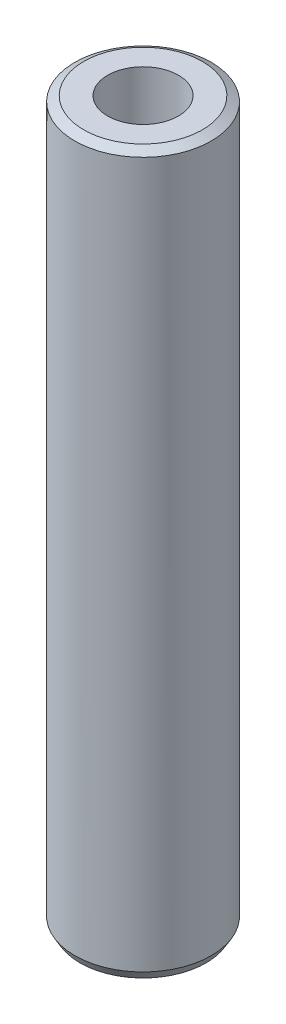
ISO-10303-21;
HEADER;
FILE_DESCRIPTION(('STEP AP214'),'2;1');
FILE_NAME('part.step','',(''),(''),'','','');
FILE_SCHEMA(('AUTOMOTIVE_DESIGN { 1 0 10303 214 1 1 1 1 }'));
ENDSEC;
DATA;
#1=APPLICATION_CONTEXT('core data for automotive mechanical design processes');
#2=APPLICATION_PROTOCOL_DEFINITION('international standard','automotive_design',2000,#1);
#3=PRODUCT_CONTEXT('',#1,'mechanical');
#4=PRODUCT('Part','Part','',(#3));
#5=PRODUCT_RELATED_PRODUCT_CATEGORY('part','',(#4));
#6=PRODUCT_DEFINITION_FORMATION('','',#4);
#7=PRODUCT_DEFINITION_CONTEXT('part definition',#1,'design');
#8=PRODUCT_DEFINITION('design','',#6,#7);
#9=PRODUCT_DEFINITION_SHAPE('','',#8);
#10=(LENGTH_UNIT() NAMED_UNIT(*) SI_UNIT(.MILLI.,.METRE.));
#11=(NAMED_UNIT(*) PLANE_ANGLE_UNIT() SI_UNIT($,.RADIAN.));
#12=(NAMED_UNIT(*) SI_UNIT($,.STERADIAN.) SOLID_ANGLE_UNIT());
#13=UNCERTAINTY_MEASURE_WITH_UNIT(LENGTH_MEASURE(1.E-05),#10,'distance_accuracy_value','');
#14=(GEOMETRIC_REPRESENTATION_CONTEXT(3) GLOBAL_UNCERTAINTY_ASSIGNED_CONTEXT((#13)) GLOBAL_UNIT_ASSIGNED_CONTEXT((#10,
#11,#12)) REPRESENTATION_CONTEXT('',''));
#15=CARTESIAN_POINT('',(0.,0.,0.));
#16=DIRECTION('',(0.,0.,1.));
#17=DIRECTION('',(1.,0.,0.));
#18=AXIS2_PLACEMENT_3D('',#15,#16,#17);
#19=CARTESIAN_POINT('',(0.,395.5855916354,0.));
#20=DIRECTION('',(0.,-1.,0.));
#21=DIRECTION('',(0.,0.,-1.));
#22=AXIS2_PLACEMENT_3D('',#19,#20,#21);
#23=CYLINDRICAL_SURFACE('',#22,37.5);
#24=CARTESIAN_POINT('',(0.,392.724823864687,0.));
#25=DIRECTION('',(0.,1.,0.));
#26=DIRECTION('',(0.,0.,1.));
#27=AXIS2_PLACEMENT_3D('',#24,#25,#26);
#28=CIRCLE('',#27,37.5);
#29=CARTESIAN_POINT('',(0.,392.724823864687,-37.5000000000001));
#30=VERTEX_POINT('',#29);
#31=EDGE_CURVE('E50',#30,#30,#28,.F.);
#32=ORIENTED_EDGE('',*,*,#31,.T.);
#33=EDGE_LOOP('',(#32));
#34=FACE_BOUND('',#33,.T.);
#35=CARTESIAN_POINT('',(0.,4.90157928391394,0.));
#36=DIRECTION('',(0.,1.,0.));
#37=DIRECTION('',(0.,0.,1.));
#38=AXIS2_PLACEMENT_3D('',#35,#36,#37);
#39=CIRCLE('',#38,37.5);
#40=CARTESIAN_POINT('',(0.,4.90157928391394,37.5));
#41=VERTEX_POINT('',#40);
#42=EDGE_CURVE('E51',#41,#41,#39,.T.);
#43=ORIENTED_EDGE('',*,*,#42,.T.);
#44=EDGE_LOOP('',(#43));
#45=FACE_BOUND('',#44,.T.);
#46=ADVANCED_FACE('F39',(#34,#45),#23,.T.);
#47=CARTESIAN_POINT('',(0.,395.5855916354,0.));
#48=DIRECTION('',(0.,1.,0.));
#49=DIRECTION('',(0.,0.,1.));
#50=AXIS2_PLACEMENT_3D('',#47,#48,#49);
#51=PLANE('',#50);
#52=CARTESIAN_POINT('',(0.,395.5855916354,0.));
#53=DIRECTION('',(0.,1.,0.));
#54=DIRECTION('',(0.,0.,1.));
#55=AXIS2_PLACEMENT_3D('',#52,#53,#54);
#56=CIRCLE('',#55,32.5984207160859);
#57=CARTESIAN_POINT('',(0.,395.5855916354,-32.5984207160859));
#58=VERTEX_POINT('',#57);
#59=EDGE_CURVE('E54',#58,#58,#56,.T.);
#60=ORIENTED_EDGE('',*,*,#59,.T.);
#61=EDGE_LOOP('',(#60));
#62=FACE_BOUND('',#61,.T.);
#63=CARTESIAN_POINT('',(0.,395.5855916354,0.));
#64=DIRECTION('',(0.,1.,0.));
#65=DIRECTION('',(0.,0.,1.));
#66=AXIS2_PLACEMENT_3D('',#63,#64,#65);
#67=CIRCLE('',#66,19.4556206193106);
#68=CARTESIAN_POINT('',(0.,395.5855916354,19.4556206193106));
#69=VERTEX_POINT('',#68);
#70=EDGE_CURVE('E58',#69,#69,#67,.T.);
#71=ORIENTED_EDGE('',*,*,#70,.F.);
#72=EDGE_LOOP('',(#71));
#73=FACE_BOUND('',#72,.T.);
#74=ADVANCED_FACE('F69',(#62,#73),#51,.T.);
#75=CARTESIAN_POINT('',(0.,0.,0.));
#76=DIRECTION('',(0.,1.,0.));
#77=DIRECTION('',(0.,0.,1.));
#78=AXIS2_PLACEMENT_3D('',#75,#76,#77);
#79=PLANE('',#78);
#80=CARTESIAN_POINT('',(0.,0.,0.));
#81=DIRECTION('',(0.,1.,0.));
#82=DIRECTION('',(0.,0.,1.));
#83=AXIS2_PLACEMENT_3D('',#80,#81,#82);
#84=CIRCLE('',#83,34.6392322292875);
#85=CARTESIAN_POINT('',(0.,0.,34.6392322292875));
#86=VERTEX_POINT('',#85);
#87=EDGE_CURVE('E10',#86,#86,#84,.F.);
#88=ORIENTED_EDGE('',*,*,#87,.T.);
#89=EDGE_LOOP('',(#88));
#90=FACE_BOUND('',#89,.T.);
#91=CARTESIAN_POINT('',(0.,0.,0.));
#92=DIRECTION('',(0.,1.,0.));
#93=DIRECTION('',(0.,0.,1.));
#94=AXIS2_PLACEMENT_3D('',#91,#92,#93);
#95=CIRCLE('',#94,19.4556206193106);
#96=CARTESIAN_POINT('',(0.,0.,19.4556206193106));
#97=VERTEX_POINT('',#96);
#98=EDGE_CURVE('E63',#97,#97,#95,.T.);
#99=ORIENTED_EDGE('',*,*,#98,.T.);
#100=EDGE_LOOP('',(#99));
#101=FACE_BOUND('',#100,.T.);
#102=ADVANCED_FACE('F75',(#90,#101),#79,.F.);
#103=CARTESIAN_POINT('',(0.,395.5855916354,0.));
#104=DIRECTION('',(0.,-1.,0.));
#105=DIRECTION('',(0.,0.,-1.));
#106=AXIS2_PLACEMENT_3D('',#103,#104,#105);
#107=CYLINDRICAL_SURFACE('',#106,19.4556206193106);
#108=ORIENTED_EDGE('',*,*,#70,.T.);
#109=EDGE_LOOP('',(#108));
#110=FACE_BOUND('',#109,.T.);
#111=ORIENTED_EDGE('',*,*,#98,.F.);
#112=EDGE_LOOP('',(#111));
#113=FACE_BOUND('',#112,.T.);
#114=ADVANCED_FACE('F70',(#110,#113),#107,.F.);
#115=CARTESIAN_POINT('',(0.,395.5855916354,0.));
#116=DIRECTION('',(0.,-1.,0.));
#117=DIRECTION('',(0.,0.,-1.));
#118=AXIS2_PLACEMENT_3D('',#115,#116,#117);
#119=CONICAL_SURFACE('',#118,32.5984207160859,1.04249157313544);
#120=CARTESIAN_POINT('',(0.,392.724823864687,-37.5000000000001));
#121=CARTESIAN_POINT('',(0.,392.754623528965,-37.4489418824593));
#122=CARTESIAN_POINT('',(0.,392.784423193244,-37.3978837649185));
#123=CARTESIAN_POINT('',(0.,392.8440225218,-37.295767529837));
#124=CARTESIAN_POINT('',(0.,392.873822186078,-37.2447094122962));
#125=CARTESIAN_POINT('',(0.,392.933421514635,-37.1425931772146));
#126=CARTESIAN_POINT('',(0.,392.963221178913,-37.0915350596739));
#127=CARTESIAN_POINT('',(0.,393.02282050747,-36.9894188245923));
#128=CARTESIAN_POINT('',(0.,393.052620171748,-36.9383607070516));
#129=CARTESIAN_POINT('',(0.,393.112219500304,-36.83624447197));
#130=CARTESIAN_POINT('',(0.,393.142019164583,-36.7851863544292));
#131=CARTESIAN_POINT('',(0.,393.201618493139,-36.6830701193477));
#132=CARTESIAN_POINT('',(0.,393.231418157417,-36.6320120018069));
#133=CARTESIAN_POINT('',(0.,393.291017485974,-36.5298957667254));
#134=CARTESIAN_POINT('',(0.,393.320817150252,-36.4788376491846));
#135=CARTESIAN_POINT('',(0.,393.380416478809,-36.3767214141031));
#136=CARTESIAN_POINT('',(0.,393.410216143087,-36.3256632965623));
#137=CARTESIAN_POINT('',(0.,393.469815471643,-36.2235470614807));
#138=CARTESIAN_POINT('',(0.,393.499615135922,-36.17248894394));
#139=CARTESIAN_POINT('',(0.,393.559214464478,-36.0703727088584));
#140=CARTESIAN_POINT('',(0.,393.589014128757,-36.0193145913177));
#141=CARTESIAN_POINT('',(0.,393.648613457313,-35.9171983562361));
#142=CARTESIAN_POINT('',(0.,393.678413121591,-35.8661402386953));
#143=CARTESIAN_POINT('',(0.,393.738012450148,-35.7640240036138));
#144=CARTESIAN_POINT('',(0.,393.767812114426,-35.712965886073));
#145=CARTESIAN_POINT('',(0.,393.827411442983,-35.6108496509915));
#146=CARTESIAN_POINT('',(0.,393.857211107261,-35.5597915334507));
#147=CARTESIAN_POINT('',(0.,393.916810435817,-35.4576752983692));
#148=CARTESIAN_POINT('',(0.,393.946610100096,-35.4066171808284));
#149=CARTESIAN_POINT('',(0.,394.006209428652,-35.3045009457469));
#150=CARTESIAN_POINT('',(0.,394.03600909293,-35.2534428282061));
#151=CARTESIAN_POINT('',(0.,394.095608421487,-35.1513265931245));
#152=CARTESIAN_POINT('',(0.,394.125408085765,-35.1002684755838));
#153=CARTESIAN_POINT('',(0.,394.185007414322,-34.9981522405022));
#154=CARTESIAN_POINT('',(0.,394.2148070786,-34.9470941229614));
#155=CARTESIAN_POINT('',(0.,394.274406407156,-34.8449778878799));
#156=CARTESIAN_POINT('',(0.,394.304206071435,-34.7939197703391));
#157=CARTESIAN_POINT('',(0.,394.363805399991,-34.6918035352576));
#158=CARTESIAN_POINT('',(0.,394.393605064269,-34.6407454177168));
#159=CARTESIAN_POINT('',(0.,394.453204392826,-34.5386291826353));
#160=CARTESIAN_POINT('',(0.,394.483004057104,-34.4875710650945));
#161=CARTESIAN_POINT('',(0.,394.542603385661,-34.3854548300129));
#162=CARTESIAN_POINT('',(0.,394.572403049939,-34.3343967124722));
#163=CARTESIAN_POINT('',(0.,394.632002378495,-34.2322804773906));
#164=CARTESIAN_POINT('',(0.,394.661802042774,-34.1812223598499));
#165=CARTESIAN_POINT('',(0.,394.72140137133,-34.0791061247683));
#166=CARTESIAN_POINT('',(0.,394.751201035609,-34.0280480072275));
#167=CARTESIAN_POINT('',(0.,394.810800364165,-33.925931772146));
#168=CARTESIAN_POINT('',(0.,394.840600028443,-33.8748736546052));
#169=CARTESIAN_POINT('',(0.,394.900199357,-33.7727574195237));
#170=CARTESIAN_POINT('',(0.,394.929999021278,-33.7216993019829));
#171=CARTESIAN_POINT('',(0.,394.989598349835,-33.6195830669014));
#172=CARTESIAN_POINT('',(0.,395.019398014113,-33.5685249493606));
#173=CARTESIAN_POINT('',(0.,395.078997342669,-33.4664087142791));
#174=CARTESIAN_POINT('',(0.,395.108797006948,-33.4153505967383));
#175=CARTESIAN_POINT('',(0.,395.168396335504,-33.3132343616567));
#176=CARTESIAN_POINT('',(0.,395.198195999782,-33.262176244116));
#177=CARTESIAN_POINT('',(0.,395.257795328339,-33.1600600090344));
#178=CARTESIAN_POINT('',(0.,395.287594992617,-33.1090018914936));
#179=CARTESIAN_POINT('',(0.,395.347194321174,-33.0068856564121));
#180=CARTESIAN_POINT('',(0.,395.376993985452,-32.9558275388713));
#181=CARTESIAN_POINT('',(0.,395.436593314008,-32.8537113037898));
#182=CARTESIAN_POINT('',(0.,395.466392978287,-32.802653186249));
#183=CARTESIAN_POINT('',(0.,395.525992306843,-32.7005369511675));
#184=CARTESIAN_POINT('',(0.,395.555791971121,-32.6494788336267));
#185=CARTESIAN_POINT('',(0.,395.5855916354,-32.5984207160859));
#186=B_SPLINE_CURVE_WITH_KNOTS('',3,(#120,#121,#122,#123,#124,#125,#126,#127,#128,#129,#130,
#131,#132,#133,#134,#135,#136,#137,#138,#139,#140,#141,#142,#143,#144,#145,#146,#147,#148,#149,
#150,#151,#152,#153,#154,#155,#156,#157,#158,#159,#160,#161,#162,#163,#164,#165,#166,#167,#168,
#169,#170,#171,#172,#173,#174,#175,#176,#177,#178,#179,#180,#181,#182,#183,#184,#185),
.UNSPECIFIED.,.F.,.F.,(4,2,2,2,2,2,2,2,2,2,2,2,2,2,2,2,2,2,2,2,2,2,2,2,2,2,2,2,2,2,2,2,4),(0.,
0.177354340857897,0.354708681715788,0.532063022573685,0.709417363431582,0.886771704289473,
1.06412604514737,1.24148038600526,1.41883472686313,1.59618906772103,1.77354340857892,
1.95089774943682,2.12825209029471,2.3056064311526,2.4829607720105,2.66031511286839,
2.83766945372626,3.01502379458416,3.19237813544205,3.36973247629995,3.54708681715784,
3.72444115801573,3.90179549887363,4.07914983973152,4.25650418058942,4.43385852144729,
4.61121286230518,4.78856720316308,4.96592154402097,5.14327588487886,5.32063022573676,
5.49798456659466,5.67533890745255),.UNSPECIFIED.);
#187=EDGE_CURVE('BSEAM81',#30,#58,#186,.T.);
#188=ORIENTED_EDGE('',*,*,#31,.F.);
#189=ORIENTED_EDGE('',*,*,#59,.F.);
#190=ORIENTED_EDGE('',*,*,#187,.T.);
#191=ORIENTED_EDGE('',*,*,#187,.F.);
#192=EDGE_LOOP('',(#188,#190,#189,#191));
#193=FACE_BOUND('',#192,.T.);
#194=ADVANCED_FACE('F81',(#193),#119,.T.);
#195=CARTESIAN_POINT('',(0.,4.90157928391394,0.));
#196=DIRECTION('',(0.,1.,0.));
#197=DIRECTION('',(0.,0.,1.));
#198=AXIS2_PLACEMENT_3D('',#195,#196,#197);
#199=CONICAL_SURFACE('',#198,37.5,0.528304753659452);
#200=ORIENTED_EDGE('',*,*,#87,.F.);
#201=EDGE_LOOP('',(#200));
#202=FACE_BOUND('',#201,.T.);
#203=ORIENTED_EDGE('',*,*,#42,.F.);
#204=EDGE_LOOP('',(#203));
#205=FACE_BOUND('',#204,.T.);
#206=ADVANCED_FACE('F45',(#202,#205),#199,.T.);
#207=CLOSED_SHELL('',(#46,#74,#102,#114,#194,#206));
#208=MANIFOLD_SOLID_BREP('B2',#207);
#209=ADVANCED_BREP_SHAPE_REPRESENTATION('',(#18,#208),#14);
#210=SHAPE_DEFINITION_REPRESENTATION(#9,#209);
ENDSEC;
END-ISO-10303-21;
